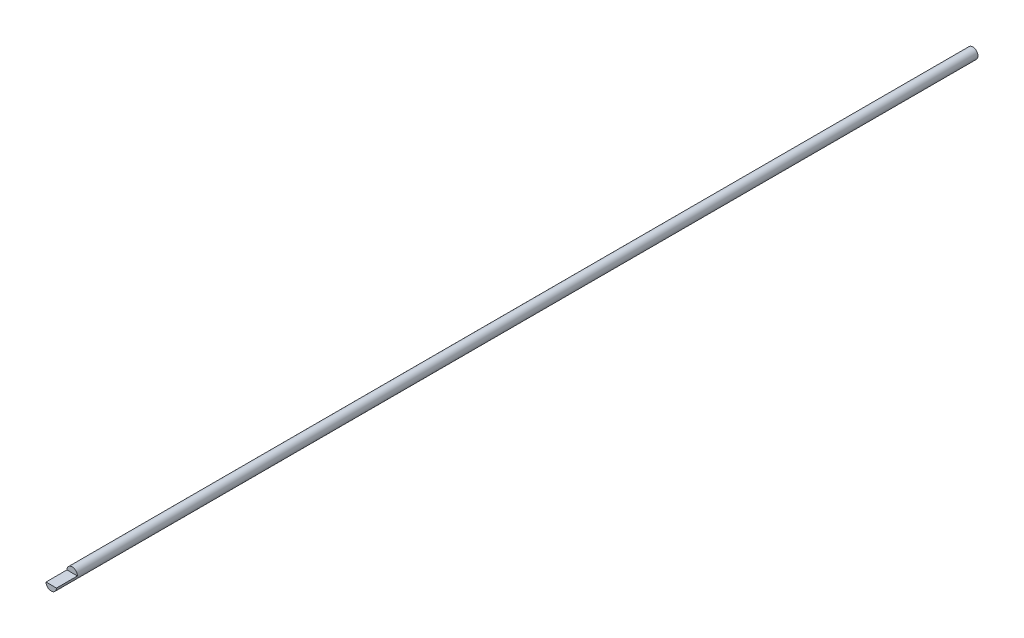
ISO-10303-21;
HEADER;
FILE_DESCRIPTION(('STEP AP214'),'2;1');
FILE_NAME('part.step','',(''),(''),'','','');
FILE_SCHEMA(('AUTOMOTIVE_DESIGN { 1 0 10303 214 1 1 1 1 }'));
ENDSEC;
DATA;
#1=APPLICATION_CONTEXT('core data for automotive mechanical design processes');
#2=APPLICATION_PROTOCOL_DEFINITION('international standard','automotive_design',2000,#1);
#3=PRODUCT_CONTEXT('',#1,'mechanical');
#4=PRODUCT('Part','Part','',(#3));
#5=PRODUCT_RELATED_PRODUCT_CATEGORY('part','',(#4));
#6=PRODUCT_DEFINITION_FORMATION('','',#4);
#7=PRODUCT_DEFINITION_CONTEXT('part definition',#1,'design');
#8=PRODUCT_DEFINITION('design','',#6,#7);
#9=PRODUCT_DEFINITION_SHAPE('','',#8);
#10=(LENGTH_UNIT() NAMED_UNIT(*) SI_UNIT(.MILLI.,.METRE.));
#11=(NAMED_UNIT(*) PLANE_ANGLE_UNIT() SI_UNIT($,.RADIAN.));
#12=(NAMED_UNIT(*) SI_UNIT($,.STERADIAN.) SOLID_ANGLE_UNIT());
#13=UNCERTAINTY_MEASURE_WITH_UNIT(LENGTH_MEASURE(1.E-05),#10,'distance_accuracy_value','');
#14=(GEOMETRIC_REPRESENTATION_CONTEXT(3) GLOBAL_UNCERTAINTY_ASSIGNED_CONTEXT((#13)) GLOBAL_UNIT_ASSIGNED_CONTEXT((#10,
#11,#12)) REPRESENTATION_CONTEXT('',''));
#15=CARTESIAN_POINT('',(0.,0.,0.));
#16=DIRECTION('',(0.,0.,1.));
#17=DIRECTION('',(1.,0.,0.));
#18=AXIS2_PLACEMENT_3D('',#15,#16,#17);
#19=CARTESIAN_POINT('',(0.,0.,558.8));
#20=DIRECTION('',(0.,0.,-1.));
#21=DIRECTION('',(-1.,0.,0.));
#22=AXIS2_PLACEMENT_3D('',#19,#20,#21);
#23=CYLINDRICAL_SURFACE('',#22,3.175);
#24=CARTESIAN_POINT('',(0.,0.,558.8));
#25=DIRECTION('',(0.,0.,1.));
#26=DIRECTION('',(1.,0.,0.));
#27=AXIS2_PLACEMENT_3D('',#24,#25,#26);
#28=CIRCLE('',#27,3.175);
#29=CARTESIAN_POINT('',(-3.175,0.,558.8));
#30=VERTEX_POINT('',#29);
#31=CARTESIAN_POINT('',(3.175,0.,558.8));
#32=VERTEX_POINT('',#31);
#33=EDGE_CURVE('E11',#30,#32,#28,.T.);
#34=ORIENTED_EDGE('',*,*,#33,.F.);
#35=DIRECTION('',(0.,0.,1.));
#36=VECTOR('',#35,1.);
#37=CARTESIAN_POINT('',(-3.175,0.,546.1));
#38=LINE('',#37,#36);
#39=CARTESIAN_POINT('',(-3.175,0.,546.1));
#40=VERTEX_POINT('',#39);
#41=EDGE_CURVE('E49',#40,#30,#38,.T.);
#42=ORIENTED_EDGE('',*,*,#41,.F.);
#43=CARTESIAN_POINT('',(0.,0.,546.1));
#44=DIRECTION('',(0.,0.,1.));
#45=DIRECTION('',(1.,0.,0.));
#46=AXIS2_PLACEMENT_3D('',#43,#44,#45);
#47=CIRCLE('',#46,3.175);
#48=CARTESIAN_POINT('',(3.175,0.,546.1));
#49=VERTEX_POINT('',#48);
#50=EDGE_CURVE('E64',#49,#40,#47,.T.);
#51=ORIENTED_EDGE('',*,*,#50,.F.);
#52=DIRECTION('',(0.,0.,1.));
#53=VECTOR('',#52,1.);
#54=CARTESIAN_POINT('',(3.175,0.,546.1));
#55=LINE('',#54,#53);
#56=EDGE_CURVE('E55',#49,#32,#55,.T.);
#57=ORIENTED_EDGE('',*,*,#56,.T.);
#58=EDGE_LOOP('',(#34,#42,#51,#57));
#59=FACE_BOUND('',#58,.T.);
#60=CARTESIAN_POINT('',(0.,0.,0.));
#61=DIRECTION('',(0.,0.,1.));
#62=DIRECTION('',(1.,0.,0.));
#63=AXIS2_PLACEMENT_3D('',#60,#61,#62);
#64=CIRCLE('',#63,3.175);
#65=CARTESIAN_POINT('',(3.175,0.,0.));
#66=VERTEX_POINT('',#65);
#67=EDGE_CURVE('E38',#66,#66,#64,.T.);
#68=ORIENTED_EDGE('',*,*,#67,.T.);
#69=EDGE_LOOP('',(#68));
#70=FACE_BOUND('',#69,.T.);
#71=ADVANCED_FACE('F35',(#59,#70),#23,.T.);
#72=CARTESIAN_POINT('',(0.,0.,558.8));
#73=DIRECTION('',(0.,0.,1.));
#74=DIRECTION('',(1.,0.,0.));
#75=AXIS2_PLACEMENT_3D('',#72,#73,#74);
#76=PLANE('',#75);
#77=DIRECTION('',(1.,0.,0.));
#78=VECTOR('',#77,1.);
#79=CARTESIAN_POINT('',(-3.175,0.,558.8));
#80=LINE('',#79,#78);
#81=EDGE_CURVE('E60',#30,#32,#80,.T.);
#82=ORIENTED_EDGE('',*,*,#81,.F.);
#83=ORIENTED_EDGE('',*,*,#33,.T.);
#84=EDGE_LOOP('',(#82,#83));
#85=FACE_BOUND('',#84,.T.);
#86=ADVANCED_FACE('F70',(#85),#76,.T.);
#87=CARTESIAN_POINT('',(0.,0.,0.));
#88=DIRECTION('',(0.,0.,1.));
#89=DIRECTION('',(1.,0.,0.));
#90=AXIS2_PLACEMENT_3D('',#87,#88,#89);
#91=PLANE('',#90);
#92=ORIENTED_EDGE('',*,*,#67,.F.);
#93=EDGE_LOOP('',(#92));
#94=FACE_BOUND('',#93,.T.);
#95=ADVANCED_FACE('F72',(#94),#91,.F.);
#96=CARTESIAN_POINT('',(-3.175,0.,546.1));
#97=DIRECTION('',(0.,-1.,0.));
#98=DIRECTION('',(0.,0.,-1.));
#99=AXIS2_PLACEMENT_3D('',#96,#97,#98);
#100=PLANE('',#99);
#101=ORIENTED_EDGE('',*,*,#81,.T.);
#102=ORIENTED_EDGE('',*,*,#56,.F.);
#103=DIRECTION('',(1.,0.,0.));
#104=VECTOR('',#103,1.);
#105=CARTESIAN_POINT('',(-3.175,0.,546.1));
#106=LINE('',#105,#104);
#107=EDGE_CURVE('E88',#40,#49,#106,.T.);
#108=ORIENTED_EDGE('',*,*,#107,.F.);
#109=ORIENTED_EDGE('',*,*,#41,.T.);
#110=EDGE_LOOP('',(#101,#102,#108,#109));
#111=FACE_BOUND('',#110,.T.);
#112=ADVANCED_FACE('F61',(#111),#100,.F.);
#113=CARTESIAN_POINT('',(0.,0.,546.1));
#114=DIRECTION('',(0.,0.,1.));
#115=DIRECTION('',(1.,0.,0.));
#116=AXIS2_PLACEMENT_3D('',#113,#114,#115);
#117=PLANE('',#116);
#118=ORIENTED_EDGE('',*,*,#50,.T.);
#119=ORIENTED_EDGE('',*,*,#107,.T.);
#120=EDGE_LOOP('',(#118,#119));
#121=FACE_BOUND('',#120,.T.);
#122=ADVANCED_FACE('F83',(#121),#117,.T.);
#123=CLOSED_SHELL('',(#71,#86,#95,#112,#122));
#124=MANIFOLD_SOLID_BREP('B2',#123);
#125=ADVANCED_BREP_SHAPE_REPRESENTATION('',(#18,#124),#14);
#126=SHAPE_DEFINITION_REPRESENTATION(#9,#125);
ENDSEC;
END-ISO-10303-21;
